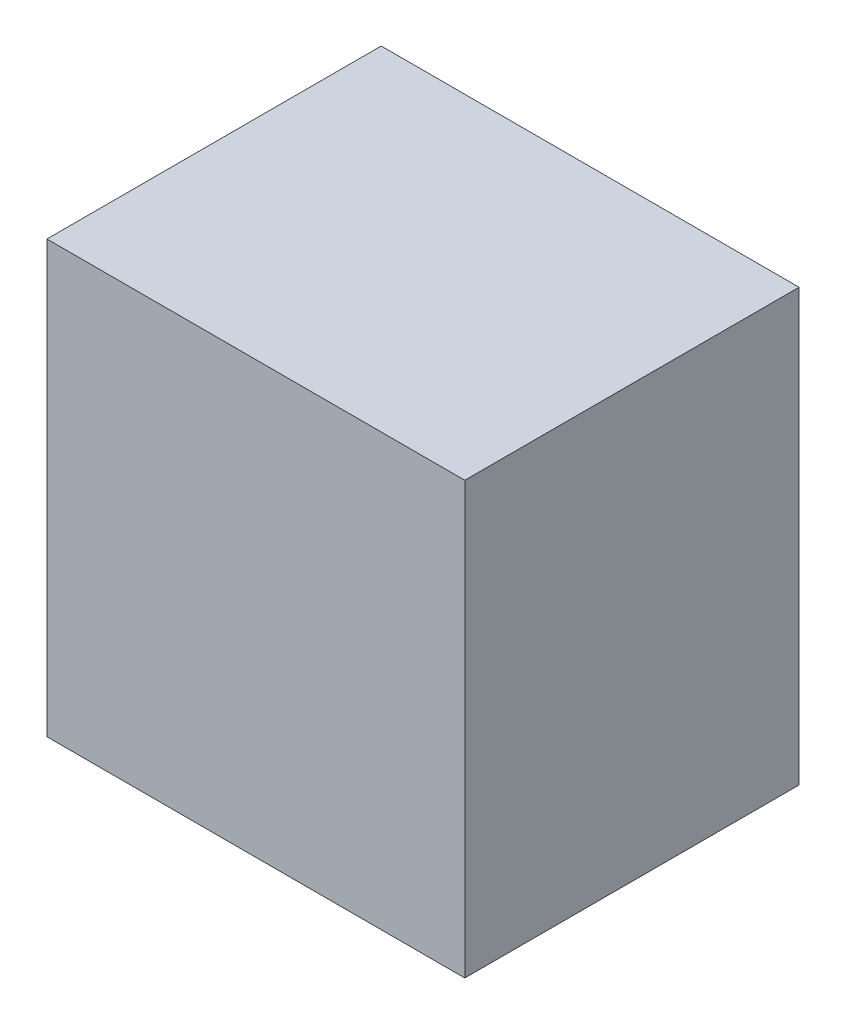
ISO-10303-21;
HEADER;
FILE_DESCRIPTION(('STEP AP214'),'2;1');
FILE_NAME('part.step','',(''),(''),'','','');
FILE_SCHEMA(('AUTOMOTIVE_DESIGN { 1 0 10303 214 1 1 1 1 }'));
ENDSEC;
DATA;
#1=APPLICATION_CONTEXT('core data for automotive mechanical design processes');
#2=APPLICATION_PROTOCOL_DEFINITION('international standard','automotive_design',2000,#1);
#3=PRODUCT_CONTEXT('',#1,'mechanical');
#4=PRODUCT('Part','Part','',(#3));
#5=PRODUCT_RELATED_PRODUCT_CATEGORY('part','',(#4));
#6=PRODUCT_DEFINITION_FORMATION('','',#4);
#7=PRODUCT_DEFINITION_CONTEXT('part definition',#1,'design');
#8=PRODUCT_DEFINITION('design','',#6,#7);
#9=PRODUCT_DEFINITION_SHAPE('','',#8);
#10=(LENGTH_UNIT() NAMED_UNIT(*) SI_UNIT(.MILLI.,.METRE.));
#11=(NAMED_UNIT(*) PLANE_ANGLE_UNIT() SI_UNIT($,.RADIAN.));
#12=(NAMED_UNIT(*) SI_UNIT($,.STERADIAN.) SOLID_ANGLE_UNIT());
#13=UNCERTAINTY_MEASURE_WITH_UNIT(LENGTH_MEASURE(1.E-05),#10,'distance_accuracy_value','');
#14=(GEOMETRIC_REPRESENTATION_CONTEXT(3) GLOBAL_UNCERTAINTY_ASSIGNED_CONTEXT((#13)) GLOBAL_UNIT_ASSIGNED_CONTEXT((#10,
#11,#12)) REPRESENTATION_CONTEXT('',''));
#15=CARTESIAN_POINT('',(0.,0.,0.));
#16=DIRECTION('',(0.,0.,1.));
#17=DIRECTION('',(1.,0.,0.));
#18=AXIS2_PLACEMENT_3D('',#15,#16,#17);
#19=CARTESIAN_POINT('',(0.,196.,0.));
#20=DIRECTION('',(1.,0.,0.));
#21=DIRECTION('',(0.,0.,-1.));
#22=AXIS2_PLACEMENT_3D('',#19,#20,#21);
#23=PLANE('',#22);
#24=DIRECTION('',(0.,0.,1.));
#25=VECTOR('',#24,1.);
#26=CARTESIAN_POINT('',(0.,0.,0.));
#27=LINE('',#26,#25);
#28=CARTESIAN_POINT('',(0.,0.,-152.));
#29=VERTEX_POINT('',#28);
#30=CARTESIAN_POINT('',(0.,0.,0.));
#31=VERTEX_POINT('',#30);
#32=EDGE_CURVE('E110',#29,#31,#27,.T.);
#33=ORIENTED_EDGE('',*,*,#32,.T.);
#34=DIRECTION('',(0.,-1.,0.));
#35=VECTOR('',#34,1.);
#36=CARTESIAN_POINT('',(0.,196.,0.));
#37=LINE('',#36,#35);
#38=CARTESIAN_POINT('',(0.,196.,0.));
#39=VERTEX_POINT('',#38);
#40=EDGE_CURVE('E11',#39,#31,#37,.T.);
#41=ORIENTED_EDGE('',*,*,#40,.F.);
#42=DIRECTION('',(0.,0.,1.));
#43=VECTOR('',#42,1.);
#44=CARTESIAN_POINT('',(0.,196.,0.));
#45=LINE('',#44,#43);
#46=CARTESIAN_POINT('',(0.,196.,-152.));
#47=VERTEX_POINT('',#46);
#48=EDGE_CURVE('E94',#47,#39,#45,.T.);
#49=ORIENTED_EDGE('',*,*,#48,.F.);
#50=DIRECTION('',(0.,-1.,0.));
#51=VECTOR('',#50,1.);
#52=CARTESIAN_POINT('',(0.,196.,-152.));
#53=LINE('',#52,#51);
#54=EDGE_CURVE('E106',#47,#29,#53,.T.);
#55=ORIENTED_EDGE('',*,*,#54,.T.);
#56=EDGE_LOOP('',(#33,#41,#49,#55));
#57=FACE_BOUND('',#56,.T.);
#58=ADVANCED_FACE('F42',(#57),#23,.F.);
#59=CARTESIAN_POINT('',(0.,196.,0.));
#60=DIRECTION('',(0.,0.,-1.));
#61=DIRECTION('',(-1.,0.,0.));
#62=AXIS2_PLACEMENT_3D('',#59,#60,#61);
#63=PLANE('',#62);
#64=DIRECTION('',(1.,0.,0.));
#65=VECTOR('',#64,1.);
#66=CARTESIAN_POINT('',(0.,0.,0.));
#67=LINE('',#66,#65);
#68=CARTESIAN_POINT('',(190.,0.,0.));
#69=VERTEX_POINT('',#68);
#70=EDGE_CURVE('E99',#31,#69,#67,.T.);
#71=ORIENTED_EDGE('',*,*,#70,.T.);
#72=DIRECTION('',(0.,-1.,0.));
#73=VECTOR('',#72,1.);
#74=CARTESIAN_POINT('',(190.,196.,0.));
#75=LINE('',#74,#73);
#76=CARTESIAN_POINT('',(190.,196.,0.));
#77=VERTEX_POINT('',#76);
#78=EDGE_CURVE('E51',#77,#69,#75,.T.);
#79=ORIENTED_EDGE('',*,*,#78,.F.);
#80=DIRECTION('',(1.,0.,0.));
#81=VECTOR('',#80,1.);
#82=CARTESIAN_POINT('',(0.,196.,0.));
#83=LINE('',#82,#81);
#84=EDGE_CURVE('E89',#39,#77,#83,.T.);
#85=ORIENTED_EDGE('',*,*,#84,.F.);
#86=ORIENTED_EDGE('',*,*,#40,.T.);
#87=EDGE_LOOP('',(#71,#79,#85,#86));
#88=FACE_BOUND('',#87,.T.);
#89=ADVANCED_FACE('F98',(#88),#63,.F.);
#90=CARTESIAN_POINT('',(190.,196.,0.));
#91=DIRECTION('',(-1.,0.,0.));
#92=DIRECTION('',(0.,0.,1.));
#93=AXIS2_PLACEMENT_3D('',#90,#91,#92);
#94=PLANE('',#93);
#95=DIRECTION('',(0.,0.,-1.));
#96=VECTOR('',#95,1.);
#97=CARTESIAN_POINT('',(190.,0.,0.));
#98=LINE('',#97,#96);
#99=CARTESIAN_POINT('',(190.,0.,-152.));
#100=VERTEX_POINT('',#99);
#101=EDGE_CURVE('E76',#69,#100,#98,.T.);
#102=ORIENTED_EDGE('',*,*,#101,.T.);
#103=DIRECTION('',(0.,-1.,0.));
#104=VECTOR('',#103,1.);
#105=CARTESIAN_POINT('',(190.,196.,-152.));
#106=LINE('',#105,#104);
#107=CARTESIAN_POINT('',(190.,196.,-152.));
#108=VERTEX_POINT('',#107);
#109=EDGE_CURVE('E101',#108,#100,#106,.T.);
#110=ORIENTED_EDGE('',*,*,#109,.F.);
#111=DIRECTION('',(0.,0.,-1.));
#112=VECTOR('',#111,1.);
#113=CARTESIAN_POINT('',(190.,196.,0.));
#114=LINE('',#113,#112);
#115=EDGE_CURVE('E92',#77,#108,#114,.T.);
#116=ORIENTED_EDGE('',*,*,#115,.F.);
#117=ORIENTED_EDGE('',*,*,#78,.T.);
#118=EDGE_LOOP('',(#102,#110,#116,#117));
#119=FACE_BOUND('',#118,.T.);
#120=ADVANCED_FACE('F102',(#119),#94,.F.);
#121=CARTESIAN_POINT('',(0.,196.,-152.));
#122=DIRECTION('',(0.,0.,1.));
#123=DIRECTION('',(1.,0.,0.));
#124=AXIS2_PLACEMENT_3D('',#121,#122,#123);
#125=PLANE('',#124);
#126=DIRECTION('',(-1.,0.,0.));
#127=VECTOR('',#126,1.);
#128=CARTESIAN_POINT('',(0.,0.,-152.));
#129=LINE('',#128,#127);
#130=EDGE_CURVE('E82',#100,#29,#129,.T.);
#131=ORIENTED_EDGE('',*,*,#130,.T.);
#132=ORIENTED_EDGE('',*,*,#54,.F.);
#133=DIRECTION('',(-1.,0.,0.));
#134=VECTOR('',#133,1.);
#135=CARTESIAN_POINT('',(0.,196.,-152.));
#136=LINE('',#135,#134);
#137=EDGE_CURVE('E59',#108,#47,#136,.T.);
#138=ORIENTED_EDGE('',*,*,#137,.F.);
#139=ORIENTED_EDGE('',*,*,#109,.T.);
#140=EDGE_LOOP('',(#131,#132,#138,#139));
#141=FACE_BOUND('',#140,.T.);
#142=ADVANCED_FACE('F123',(#141),#125,.F.);
#143=CARTESIAN_POINT('',(0.,196.,0.));
#144=DIRECTION('',(0.,-1.,0.));
#145=DIRECTION('',(0.,0.,-1.));
#146=AXIS2_PLACEMENT_3D('',#143,#144,#145);
#147=PLANE('',#146);
#148=ORIENTED_EDGE('',*,*,#48,.T.);
#149=ORIENTED_EDGE('',*,*,#84,.T.);
#150=ORIENTED_EDGE('',*,*,#115,.T.);
#151=ORIENTED_EDGE('',*,*,#137,.T.);
#152=EDGE_LOOP('',(#148,#149,#150,#151));
#153=FACE_BOUND('',#152,.T.);
#154=ADVANCED_FACE('F90',(#153),#147,.F.);
#155=CARTESIAN_POINT('',(0.,0.,0.));
#156=DIRECTION('',(0.,-1.,0.));
#157=DIRECTION('',(0.,0.,-1.));
#158=AXIS2_PLACEMENT_3D('',#155,#156,#157);
#159=PLANE('',#158);
#160=ORIENTED_EDGE('',*,*,#32,.F.);
#161=ORIENTED_EDGE('',*,*,#130,.F.);
#162=ORIENTED_EDGE('',*,*,#101,.F.);
#163=ORIENTED_EDGE('',*,*,#70,.F.);
#164=EDGE_LOOP('',(#160,#161,#162,#163));
#165=FACE_BOUND('',#164,.T.);
#166=ADVANCED_FACE('F126',(#165),#159,.T.);
#167=CLOSED_SHELL('',(#58,#89,#120,#142,#154,#166));
#168=MANIFOLD_SOLID_BREP('B2',#167);
#169=ADVANCED_BREP_SHAPE_REPRESENTATION('',(#18,#168),#14);
#170=SHAPE_DEFINITION_REPRESENTATION(#9,#169);
ENDSEC;
END-ISO-10303-21;
